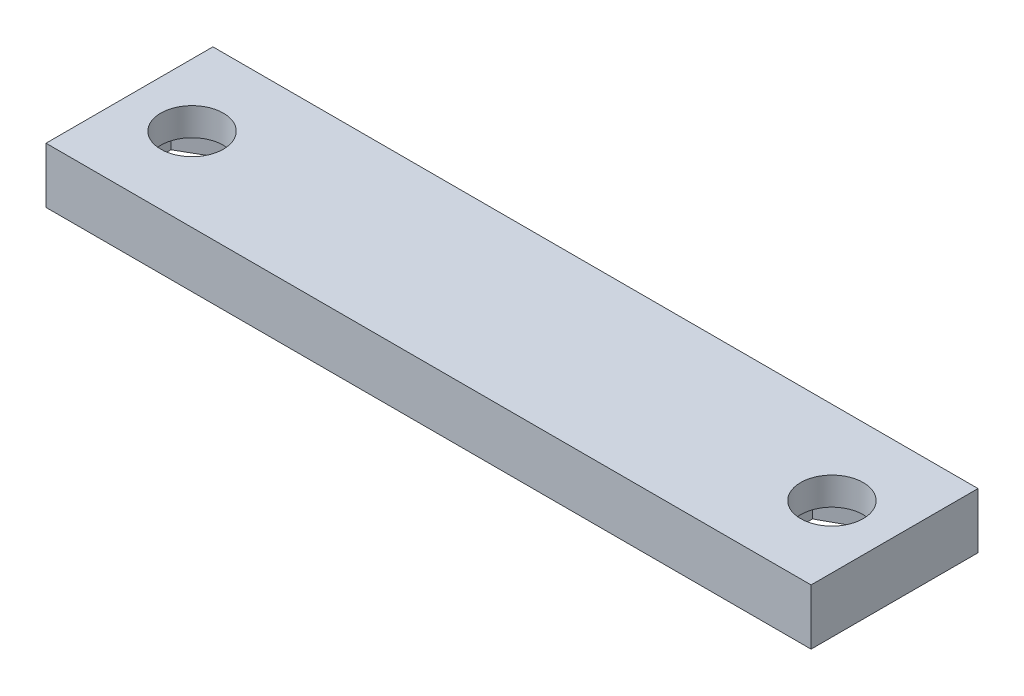
ISO-10303-21;
HEADER;
FILE_DESCRIPTION(('STEP AP214'),'2;1');
FILE_NAME('part.step','',(''),(''),'','','');
FILE_SCHEMA(('AUTOMOTIVE_DESIGN { 1 0 10303 214 1 1 1 1 }'));
ENDSEC;
DATA;
#1=APPLICATION_CONTEXT('core data for automotive mechanical design processes');
#2=APPLICATION_PROTOCOL_DEFINITION('international standard','automotive_design',2000,#1);
#3=PRODUCT_CONTEXT('',#1,'mechanical');
#4=PRODUCT('Part','Part','',(#3));
#5=PRODUCT_RELATED_PRODUCT_CATEGORY('part','',(#4));
#6=PRODUCT_DEFINITION_FORMATION('','',#4);
#7=PRODUCT_DEFINITION_CONTEXT('part definition',#1,'design');
#8=PRODUCT_DEFINITION('design','',#6,#7);
#9=PRODUCT_DEFINITION_SHAPE('','',#8);
#10=(LENGTH_UNIT() NAMED_UNIT(*) SI_UNIT(.MILLI.,.METRE.));
#11=(NAMED_UNIT(*) PLANE_ANGLE_UNIT() SI_UNIT($,.RADIAN.));
#12=(NAMED_UNIT(*) SI_UNIT($,.STERADIAN.) SOLID_ANGLE_UNIT());
#13=UNCERTAINTY_MEASURE_WITH_UNIT(LENGTH_MEASURE(1.E-05),#10,'distance_accuracy_value','');
#14=(GEOMETRIC_REPRESENTATION_CONTEXT(3) GLOBAL_UNCERTAINTY_ASSIGNED_CONTEXT((#13)) GLOBAL_UNIT_ASSIGNED_CONTEXT((#10,
#11,#12)) REPRESENTATION_CONTEXT('',''));
#15=CARTESIAN_POINT('',(0.,0.,0.));
#16=DIRECTION('',(0.,0.,1.));
#17=DIRECTION('',(1.,0.,0.));
#18=AXIS2_PLACEMENT_3D('',#15,#16,#17);
#19=CARTESIAN_POINT('',(-23.,4.,0.));
#20=DIRECTION('',(0.,-1.,0.));
#21=DIRECTION('',(0.,0.,-1.));
#22=AXIS2_PLACEMENT_3D('',#19,#20,#21);
#23=CYLINDRICAL_SURFACE('',#22,2.25);
#24=CARTESIAN_POINT('',(-23.,4.,0.));
#25=DIRECTION('',(0.,1.,0.));
#26=DIRECTION('',(0.,0.,1.));
#27=AXIS2_PLACEMENT_3D('',#24,#25,#26);
#28=CIRCLE('',#27,2.25);
#29=CARTESIAN_POINT('',(-23.,4.,2.25));
#30=VERTEX_POINT('',#29);
#31=EDGE_CURVE('E252',#30,#30,#28,.T.);
#32=ORIENTED_EDGE('',*,*,#31,.T.);
#33=EDGE_LOOP('',(#32));
#34=FACE_BOUND('',#33,.T.);
#35=CARTESIAN_POINT('',(-23.,2.,0.));
#36=DIRECTION('',(0.,-1.,0.));
#37=DIRECTION('',(0.,0.,-1.));
#38=AXIS2_PLACEMENT_3D('',#35,#36,#37);
#39=CIRCLE('',#38,2.25);
#40=CARTESIAN_POINT('',(-23.,2.,-2.25));
#41=VERTEX_POINT('',#40);
#42=EDGE_CURVE('E37',#41,#41,#39,.T.);
#43=ORIENTED_EDGE('',*,*,#42,.T.);
#44=EDGE_LOOP('',(#43));
#45=FACE_BOUND('',#44,.T.);
#46=ADVANCED_FACE('F33',(#34,#45),#23,.F.);
#47=CARTESIAN_POINT('',(23.,4.,0.));
#48=DIRECTION('',(0.,-1.,0.));
#49=DIRECTION('',(0.,0.,-1.));
#50=AXIS2_PLACEMENT_3D('',#47,#48,#49);
#51=CYLINDRICAL_SURFACE('',#50,2.25);
#52=CARTESIAN_POINT('',(23.,4.,0.));
#53=DIRECTION('',(0.,1.,0.));
#54=DIRECTION('',(0.,0.,1.));
#55=AXIS2_PLACEMENT_3D('',#52,#53,#54);
#56=CIRCLE('',#55,2.25);
#57=CARTESIAN_POINT('',(23.,4.,2.25));
#58=VERTEX_POINT('',#57);
#59=EDGE_CURVE('E249',#58,#58,#56,.T.);
#60=ORIENTED_EDGE('',*,*,#59,.T.);
#61=EDGE_LOOP('',(#60));
#62=FACE_BOUND('',#61,.T.);
#63=CARTESIAN_POINT('',(23.,2.,0.));
#64=DIRECTION('',(0.,-1.,0.));
#65=DIRECTION('',(0.,0.,-1.));
#66=AXIS2_PLACEMENT_3D('',#63,#64,#65);
#67=CIRCLE('',#66,2.25);
#68=CARTESIAN_POINT('',(23.,2.,-2.25));
#69=VERTEX_POINT('',#68);
#70=EDGE_CURVE('E239',#69,#69,#67,.T.);
#71=ORIENTED_EDGE('',*,*,#70,.T.);
#72=EDGE_LOOP('',(#71));
#73=FACE_BOUND('',#72,.T.);
#74=ADVANCED_FACE('F283',(#62,#73),#51,.F.);
#75=CARTESIAN_POINT('',(0.,4.,0.));
#76=DIRECTION('',(0.,1.,0.));
#77=DIRECTION('',(0.,0.,1.));
#78=AXIS2_PLACEMENT_3D('',#75,#76,#77);
#79=PLANE('',#78);
#80=ORIENTED_EDGE('',*,*,#31,.F.);
#81=EDGE_LOOP('',(#80));
#82=FACE_BOUND('',#81,.T.);
#83=DIRECTION('',(0.,0.,-1.));
#84=VECTOR('',#83,1.);
#85=CARTESIAN_POINT('',(27.5,4.,-6.));
#86=LINE('',#85,#84);
#87=CARTESIAN_POINT('',(27.5,4.,6.));
#88=VERTEX_POINT('',#87);
#89=CARTESIAN_POINT('',(27.5,4.,-6.));
#90=VERTEX_POINT('',#89);
#91=EDGE_CURVE('E256',#88,#90,#86,.T.);
#92=ORIENTED_EDGE('',*,*,#91,.T.);
#93=DIRECTION('',(-1.,0.,0.));
#94=VECTOR('',#93,1.);
#95=CARTESIAN_POINT('',(-27.5,4.,-6.));
#96=LINE('',#95,#94);
#97=CARTESIAN_POINT('',(-27.5,4.,-6.));
#98=VERTEX_POINT('',#97);
#99=EDGE_CURVE('E259',#90,#98,#96,.T.);
#100=ORIENTED_EDGE('',*,*,#99,.T.);
#101=DIRECTION('',(0.,0.,1.));
#102=VECTOR('',#101,1.);
#103=CARTESIAN_POINT('',(-27.5,4.,-6.));
#104=LINE('',#103,#102);
#105=CARTESIAN_POINT('',(-27.5,4.,6.));
#106=VERTEX_POINT('',#105);
#107=EDGE_CURVE('E262',#98,#106,#104,.T.);
#108=ORIENTED_EDGE('',*,*,#107,.T.);
#109=DIRECTION('',(1.,0.,0.));
#110=VECTOR('',#109,1.);
#111=CARTESIAN_POINT('',(-27.5,4.,6.));
#112=LINE('',#111,#110);
#113=EDGE_CURVE('E264',#106,#88,#112,.T.);
#114=ORIENTED_EDGE('',*,*,#113,.T.);
#115=EDGE_LOOP('',(#92,#100,#108,#114));
#116=FACE_BOUND('',#115,.T.);
#117=ORIENTED_EDGE('',*,*,#59,.F.);
#118=EDGE_LOOP('',(#117));
#119=FACE_BOUND('',#118,.T.);
#120=ADVANCED_FACE('F315',(#82,#116,#119),#79,.T.);
#121=CARTESIAN_POINT('',(0.,0.,0.));
#122=DIRECTION('',(0.,1.,0.));
#123=DIRECTION('',(0.,0.,1.));
#124=AXIS2_PLACEMENT_3D('',#121,#122,#123);
#125=PLANE('',#124);
#126=DIRECTION('',(0.866025403784439,0.,0.5));
#127=VECTOR('',#126,1.);
#128=CARTESIAN_POINT('',(-23.,0.,-4.15692193816531));
#129=LINE('',#128,#127);
#130=CARTESIAN_POINT('',(-23.,0.,-4.15692193816531));
#131=VERTEX_POINT('',#130);
#132=CARTESIAN_POINT('',(-19.4,0.,-2.07846096908265));
#133=VERTEX_POINT('',#132);
#134=EDGE_CURVE('E183',#131,#133,#129,.T.);
#135=ORIENTED_EDGE('',*,*,#134,.F.);
#136=DIRECTION('',(0.866025403784439,0.,-0.5));
#137=VECTOR('',#136,1.);
#138=CARTESIAN_POINT('',(-26.6,0.,-2.07846096908265));
#139=LINE('',#138,#137);
#140=CARTESIAN_POINT('',(-26.6,0.,-2.07846096908265));
#141=VERTEX_POINT('',#140);
#142=EDGE_CURVE('E50',#141,#131,#139,.T.);
#143=ORIENTED_EDGE('',*,*,#142,.F.);
#144=DIRECTION('',(0.,0.,-1.));
#145=VECTOR('',#144,1.);
#146=CARTESIAN_POINT('',(-26.6,0.,2.07846096908265));
#147=LINE('',#146,#145);
#148=CARTESIAN_POINT('',(-26.6,0.,2.07846096908265));
#149=VERTEX_POINT('',#148);
#150=EDGE_CURVE('E169',#149,#141,#147,.T.);
#151=ORIENTED_EDGE('',*,*,#150,.F.);
#152=DIRECTION('',(-0.866025403784439,0.,-0.5));
#153=VECTOR('',#152,1.);
#154=CARTESIAN_POINT('',(-23.,0.,4.15692193816531));
#155=LINE('',#154,#153);
#156=CARTESIAN_POINT('',(-23.,0.,4.15692193816531));
#157=VERTEX_POINT('',#156);
#158=EDGE_CURVE('E172',#157,#149,#155,.T.);
#159=ORIENTED_EDGE('',*,*,#158,.F.);
#160=DIRECTION('',(-0.866025403784439,0.,0.5));
#161=VECTOR('',#160,1.);
#162=CARTESIAN_POINT('',(-19.4,0.,2.07846096908265));
#163=LINE('',#162,#161);
#164=CARTESIAN_POINT('',(-19.4,0.,2.07846096908265));
#165=VERTEX_POINT('',#164);
#166=EDGE_CURVE('E188',#165,#157,#163,.T.);
#167=ORIENTED_EDGE('',*,*,#166,.F.);
#168=DIRECTION('',(0.,0.,1.));
#169=VECTOR('',#168,1.);
#170=CARTESIAN_POINT('',(-19.4,0.,-2.07846096908265));
#171=LINE('',#170,#169);
#172=EDGE_CURVE('E185',#133,#165,#171,.T.);
#173=ORIENTED_EDGE('',*,*,#172,.F.);
#174=EDGE_LOOP('',(#135,#143,#151,#159,#167,#173));
#175=FACE_BOUND('',#174,.T.);
#176=DIRECTION('',(0.877399501832216,0.,-0.479760475846623));
#177=VECTOR('',#176,1.);
#178=CARTESIAN_POINT('',(19.4492216681013,0.,-2.16147478304026));
#179=LINE('',#178,#177);
#180=CARTESIAN_POINT('',(19.4492216681013,0.,-2.16147478304026));
#181=VERTEX_POINT('',#180);
#182=CARTESIAN_POINT('',(23.096502905803,0.,-4.15580163015171));
#183=VERTEX_POINT('',#182);
#184=EDGE_CURVE('E223',#181,#183,#179,.T.);
#185=ORIENTED_EDGE('',*,*,#184,.F.);
#186=DIRECTION('',(0.0232149911012231,0.,-0.999730495777822));
#187=VECTOR('',#186,1.);
#188=CARTESIAN_POINT('',(19.3527187622984,0.,1.99432684711145));
#189=LINE('',#188,#187);
#190=CARTESIAN_POINT('',(19.3527187622984,0.,1.99432684711145));
#191=VERTEX_POINT('',#190);
#192=EDGE_CURVE('E58',#191,#181,#189,.T.);
#193=ORIENTED_EDGE('',*,*,#192,.F.);
#194=DIRECTION('',(-0.854184510730994,0.,-0.5199700199312));
#195=VECTOR('',#194,1.);
#196=CARTESIAN_POINT('',(22.903497094197,0.,4.1558016301517));
#197=LINE('',#196,#195);
#198=CARTESIAN_POINT('',(22.903497094197,0.,4.1558016301517));
#199=VERTEX_POINT('',#198);
#200=EDGE_CURVE('E206',#199,#191,#197,.T.);
#201=ORIENTED_EDGE('',*,*,#200,.F.);
#202=DIRECTION('',(-0.877399501832217,0.,0.479760475846623));
#203=VECTOR('',#202,1.);
#204=CARTESIAN_POINT('',(26.5507783318987,0.,2.16147478304025));
#205=LINE('',#204,#203);
#206=CARTESIAN_POINT('',(26.5507783318987,0.,2.16147478304025));
#207=VERTEX_POINT('',#206);
#208=EDGE_CURVE('E232',#207,#199,#205,.T.);
#209=ORIENTED_EDGE('',*,*,#208,.F.);
#210=DIRECTION('',(-0.0232149911012231,0.,0.999730495777822));
#211=VECTOR('',#210,1.);
#212=CARTESIAN_POINT('',(26.6472812377017,0.,-1.99432684711145));
#213=LINE('',#212,#211);
#214=CARTESIAN_POINT('',(26.6472812377017,0.,-1.99432684711145));
#215=VERTEX_POINT('',#214);
#216=EDGE_CURVE('E229',#215,#207,#213,.T.);
#217=ORIENTED_EDGE('',*,*,#216,.F.);
#218=DIRECTION('',(0.854184510730994,0.,0.5199700199312));
#219=VECTOR('',#218,1.);
#220=CARTESIAN_POINT('',(23.096502905803,0.,-4.15580163015171));
#221=LINE('',#220,#219);
#222=EDGE_CURVE('E226',#183,#215,#221,.T.);
#223=ORIENTED_EDGE('',*,*,#222,.F.);
#224=EDGE_LOOP('',(#185,#193,#201,#209,#217,#223));
#225=FACE_BOUND('',#224,.T.);
#226=DIRECTION('',(0.,0.,-1.));
#227=VECTOR('',#226,1.);
#228=CARTESIAN_POINT('',(27.5,0.,-6.));
#229=LINE('',#228,#227);
#230=CARTESIAN_POINT('',(27.5,0.,6.));
#231=VERTEX_POINT('',#230);
#232=CARTESIAN_POINT('',(27.5,0.,-6.));
#233=VERTEX_POINT('',#232);
#234=EDGE_CURVE('E255',#231,#233,#229,.T.);
#235=ORIENTED_EDGE('',*,*,#234,.F.);
#236=DIRECTION('',(1.,0.,0.));
#237=VECTOR('',#236,1.);
#238=CARTESIAN_POINT('',(-27.5,0.,6.));
#239=LINE('',#238,#237);
#240=CARTESIAN_POINT('',(-27.5,0.,6.));
#241=VERTEX_POINT('',#240);
#242=EDGE_CURVE('E260',#241,#231,#239,.T.);
#243=ORIENTED_EDGE('',*,*,#242,.F.);
#244=DIRECTION('',(0.,0.,1.));
#245=VECTOR('',#244,1.);
#246=CARTESIAN_POINT('',(-27.5,0.,-6.));
#247=LINE('',#246,#245);
#248=CARTESIAN_POINT('',(-27.5,0.,-6.));
#249=VERTEX_POINT('',#248);
#250=EDGE_CURVE('E271',#249,#241,#247,.T.);
#251=ORIENTED_EDGE('',*,*,#250,.F.);
#252=DIRECTION('',(-1.,0.,0.));
#253=VECTOR('',#252,1.);
#254=CARTESIAN_POINT('',(-27.5,0.,-6.));
#255=LINE('',#254,#253);
#256=EDGE_CURVE('E269',#233,#249,#255,.T.);
#257=ORIENTED_EDGE('',*,*,#256,.F.);
#258=EDGE_LOOP('',(#235,#243,#251,#257));
#259=FACE_BOUND('',#258,.T.);
#260=ADVANCED_FACE('F312',(#175,#225,#259),#125,.F.);
#261=CARTESIAN_POINT('',(27.5,4.,-6.));
#262=DIRECTION('',(-1.,0.,0.));
#263=DIRECTION('',(0.,0.,1.));
#264=AXIS2_PLACEMENT_3D('',#261,#262,#263);
#265=PLANE('',#264);
#266=ORIENTED_EDGE('',*,*,#234,.T.);
#267=DIRECTION('',(0.,-1.,0.));
#268=VECTOR('',#267,1.);
#269=CARTESIAN_POINT('',(27.5,4.,-6.));
#270=LINE('',#269,#268);
#271=EDGE_CURVE('E11',#90,#233,#270,.T.);
#272=ORIENTED_EDGE('',*,*,#271,.F.);
#273=ORIENTED_EDGE('',*,*,#91,.F.);
#274=DIRECTION('',(0.,-1.,0.));
#275=VECTOR('',#274,1.);
#276=CARTESIAN_POINT('',(27.5,4.,6.));
#277=LINE('',#276,#275);
#278=EDGE_CURVE('E266',#88,#231,#277,.T.);
#279=ORIENTED_EDGE('',*,*,#278,.T.);
#280=EDGE_LOOP('',(#266,#272,#273,#279));
#281=FACE_BOUND('',#280,.T.);
#282=ADVANCED_FACE('F35',(#281),#265,.F.);
#283=CARTESIAN_POINT('',(-27.5,4.,-6.));
#284=DIRECTION('',(0.,0.,1.));
#285=DIRECTION('',(1.,0.,0.));
#286=AXIS2_PLACEMENT_3D('',#283,#284,#285);
#287=PLANE('',#286);
#288=ORIENTED_EDGE('',*,*,#256,.T.);
#289=DIRECTION('',(0.,-1.,0.));
#290=VECTOR('',#289,1.);
#291=CARTESIAN_POINT('',(-27.5,4.,-6.));
#292=LINE('',#291,#290);
#293=EDGE_CURVE('E42',#98,#249,#292,.T.);
#294=ORIENTED_EDGE('',*,*,#293,.F.);
#295=ORIENTED_EDGE('',*,*,#99,.F.);
#296=ORIENTED_EDGE('',*,*,#271,.T.);
#297=EDGE_LOOP('',(#288,#294,#295,#296));
#298=FACE_BOUND('',#297,.T.);
#299=ADVANCED_FACE('F334',(#298),#287,.F.);
#300=CARTESIAN_POINT('',(-27.5,4.,-6.));
#301=DIRECTION('',(1.,0.,0.));
#302=DIRECTION('',(0.,0.,-1.));
#303=AXIS2_PLACEMENT_3D('',#300,#301,#302);
#304=PLANE('',#303);
#305=ORIENTED_EDGE('',*,*,#250,.T.);
#306=DIRECTION('',(0.,-1.,0.));
#307=VECTOR('',#306,1.);
#308=CARTESIAN_POINT('',(-27.5,4.,6.));
#309=LINE('',#308,#307);
#310=EDGE_CURVE('E276',#106,#241,#309,.T.);
#311=ORIENTED_EDGE('',*,*,#310,.F.);
#312=ORIENTED_EDGE('',*,*,#107,.F.);
#313=ORIENTED_EDGE('',*,*,#293,.T.);
#314=EDGE_LOOP('',(#305,#311,#312,#313));
#315=FACE_BOUND('',#314,.T.);
#316=ADVANCED_FACE('F331',(#315),#304,.F.);
#317=CARTESIAN_POINT('',(-27.5,4.,6.));
#318=DIRECTION('',(0.,0.,-1.));
#319=DIRECTION('',(-1.,0.,0.));
#320=AXIS2_PLACEMENT_3D('',#317,#318,#319);
#321=PLANE('',#320);
#322=ORIENTED_EDGE('',*,*,#242,.T.);
#323=ORIENTED_EDGE('',*,*,#278,.F.);
#324=ORIENTED_EDGE('',*,*,#113,.F.);
#325=ORIENTED_EDGE('',*,*,#310,.T.);
#326=EDGE_LOOP('',(#322,#323,#324,#325));
#327=FACE_BOUND('',#326,.T.);
#328=ADVANCED_FACE('F327',(#327),#321,.F.);
#329=CARTESIAN_POINT('',(19.3527187622984,2.,1.99432684711145));
#330=DIRECTION('',(-0.999730495777822,0.,-0.0232149911012231));
#331=DIRECTION('',(-0.0232149911012231,0.,0.999730495777822));
#332=AXIS2_PLACEMENT_3D('',#329,#330,#331);
#333=PLANE('',#332);
#334=ORIENTED_EDGE('',*,*,#192,.T.);
#335=DIRECTION('',(0.,-1.,0.));
#336=VECTOR('',#335,1.);
#337=CARTESIAN_POINT('',(19.4492216681013,2.,-2.16147478304026));
#338=LINE('',#337,#336);
#339=CARTESIAN_POINT('',(19.4492216681013,2.,-2.16147478304026));
#340=VERTEX_POINT('',#339);
#341=EDGE_CURVE('E221',#340,#181,#338,.T.);
#342=ORIENTED_EDGE('',*,*,#341,.F.);
#343=DIRECTION('',(0.0232149911012231,0.,-0.999730495777822));
#344=VECTOR('',#343,1.);
#345=CARTESIAN_POINT('',(19.3527187622984,2.,1.99432684711145));
#346=LINE('',#345,#344);
#347=CARTESIAN_POINT('',(19.3527187622984,2.,1.99432684711145));
#348=VERTEX_POINT('',#347);
#349=EDGE_CURVE('E202',#348,#340,#346,.T.);
#350=ORIENTED_EDGE('',*,*,#349,.F.);
#351=DIRECTION('',(0.,-1.,0.));
#352=VECTOR('',#351,1.);
#353=CARTESIAN_POINT('',(19.3527187622984,2.,1.99432684711145));
#354=LINE('',#353,#352);
#355=EDGE_CURVE('E237',#348,#191,#354,.T.);
#356=ORIENTED_EDGE('',*,*,#355,.T.);
#357=EDGE_LOOP('',(#334,#342,#350,#356));
#358=FACE_BOUND('',#357,.T.);
#359=ADVANCED_FACE('F293',(#358),#333,.F.);
#360=CARTESIAN_POINT('',(22.903497094197,2.,4.1558016301517));
#361=DIRECTION('',(-0.5199700199312,0.,0.854184510730994));
#362=DIRECTION('',(0.854184510730994,0.,0.5199700199312));
#363=AXIS2_PLACEMENT_3D('',#360,#361,#362);
#364=PLANE('',#363);
#365=ORIENTED_EDGE('',*,*,#200,.T.);
#366=ORIENTED_EDGE('',*,*,#355,.F.);
#367=DIRECTION('',(-0.854184510730994,0.,-0.5199700199312));
#368=VECTOR('',#367,1.);
#369=CARTESIAN_POINT('',(22.903497094197,2.,4.1558016301517));
#370=LINE('',#369,#368);
#371=CARTESIAN_POINT('',(22.903497094197,2.,4.1558016301517));
#372=VERTEX_POINT('',#371);
#373=EDGE_CURVE('E218',#372,#348,#370,.T.);
#374=ORIENTED_EDGE('',*,*,#373,.F.);
#375=DIRECTION('',(0.,-1.,0.));
#376=VECTOR('',#375,1.);
#377=CARTESIAN_POINT('',(22.903497094197,2.,4.1558016301517));
#378=LINE('',#377,#376);
#379=EDGE_CURVE('E240',#372,#199,#378,.T.);
#380=ORIENTED_EDGE('',*,*,#379,.T.);
#381=EDGE_LOOP('',(#365,#366,#374,#380));
#382=FACE_BOUND('',#381,.T.);
#383=ADVANCED_FACE('F310',(#382),#364,.F.);
#384=CARTESIAN_POINT('',(26.5507783318987,2.,2.16147478304025));
#385=DIRECTION('',(0.479760475846623,0.,0.877399501832217));
#386=DIRECTION('',(0.877399501832217,0.,-0.479760475846623));
#387=AXIS2_PLACEMENT_3D('',#384,#385,#386);
#388=PLANE('',#387);
#389=ORIENTED_EDGE('',*,*,#208,.T.);
#390=ORIENTED_EDGE('',*,*,#379,.F.);
#391=DIRECTION('',(-0.877399501832217,0.,0.479760475846623));
#392=VECTOR('',#391,1.);
#393=CARTESIAN_POINT('',(26.5507783318987,2.,2.16147478304025));
#394=LINE('',#393,#392);
#395=CARTESIAN_POINT('',(26.5507783318987,2.,2.16147478304025));
#396=VERTEX_POINT('',#395);
#397=EDGE_CURVE('E215',#396,#372,#394,.T.);
#398=ORIENTED_EDGE('',*,*,#397,.F.);
#399=DIRECTION('',(0.,-1.,0.));
#400=VECTOR('',#399,1.);
#401=CARTESIAN_POINT('',(26.5507783318987,2.,2.16147478304025));
#402=LINE('',#401,#400);
#403=EDGE_CURVE('E242',#396,#207,#402,.T.);
#404=ORIENTED_EDGE('',*,*,#403,.T.);
#405=EDGE_LOOP('',(#389,#390,#398,#404));
#406=FACE_BOUND('',#405,.T.);
#407=ADVANCED_FACE('F307',(#406),#388,.F.);
#408=CARTESIAN_POINT('',(26.6472812377017,2.,-1.99432684711145));
#409=DIRECTION('',(0.999730495777822,0.,0.0232149911012231));
#410=DIRECTION('',(0.0232149911012231,0.,-0.999730495777822));
#411=AXIS2_PLACEMENT_3D('',#408,#409,#410);
#412=PLANE('',#411);
#413=ORIENTED_EDGE('',*,*,#216,.T.);
#414=ORIENTED_EDGE('',*,*,#403,.F.);
#415=DIRECTION('',(-0.0232149911012231,0.,0.999730495777822));
#416=VECTOR('',#415,1.);
#417=CARTESIAN_POINT('',(26.6472812377017,2.,-1.99432684711145));
#418=LINE('',#417,#416);
#419=CARTESIAN_POINT('',(26.6472812377017,2.,-1.99432684711145));
#420=VERTEX_POINT('',#419);
#421=EDGE_CURVE('E212',#420,#396,#418,.T.);
#422=ORIENTED_EDGE('',*,*,#421,.F.);
#423=DIRECTION('',(0.,-1.,0.));
#424=VECTOR('',#423,1.);
#425=CARTESIAN_POINT('',(26.6472812377017,2.,-1.99432684711145));
#426=LINE('',#425,#424);
#427=EDGE_CURVE('E244',#420,#215,#426,.T.);
#428=ORIENTED_EDGE('',*,*,#427,.T.);
#429=EDGE_LOOP('',(#413,#414,#422,#428));
#430=FACE_BOUND('',#429,.T.);
#431=ADVANCED_FACE('F303',(#430),#412,.F.);
#432=CARTESIAN_POINT('',(23.096502905803,2.,-4.15580163015171));
#433=DIRECTION('',(0.5199700199312,0.,-0.854184510730994));
#434=DIRECTION('',(-0.854184510730994,0.,-0.5199700199312));
#435=AXIS2_PLACEMENT_3D('',#432,#433,#434);
#436=PLANE('',#435);
#437=ORIENTED_EDGE('',*,*,#222,.T.);
#438=ORIENTED_EDGE('',*,*,#427,.F.);
#439=DIRECTION('',(0.854184510730994,0.,0.5199700199312));
#440=VECTOR('',#439,1.);
#441=CARTESIAN_POINT('',(23.096502905803,2.,-4.15580163015171));
#442=LINE('',#441,#440);
#443=CARTESIAN_POINT('',(23.096502905803,2.,-4.15580163015171));
#444=VERTEX_POINT('',#443);
#445=EDGE_CURVE('E209',#444,#420,#442,.T.);
#446=ORIENTED_EDGE('',*,*,#445,.F.);
#447=DIRECTION('',(0.,-1.,0.));
#448=VECTOR('',#447,1.);
#449=CARTESIAN_POINT('',(23.096502905803,2.,-4.15580163015171));
#450=LINE('',#449,#448);
#451=EDGE_CURVE('E246',#444,#183,#450,.T.);
#452=ORIENTED_EDGE('',*,*,#451,.T.);
#453=EDGE_LOOP('',(#437,#438,#446,#452));
#454=FACE_BOUND('',#453,.T.);
#455=ADVANCED_FACE('F299',(#454),#436,.F.);
#456=CARTESIAN_POINT('',(19.4492216681013,2.,-2.16147478304026));
#457=DIRECTION('',(-0.479760475846623,0.,-0.877399501832217));
#458=DIRECTION('',(-0.877399501832217,0.,0.479760475846623));
#459=AXIS2_PLACEMENT_3D('',#456,#457,#458);
#460=PLANE('',#459);
#461=ORIENTED_EDGE('',*,*,#184,.T.);
#462=ORIENTED_EDGE('',*,*,#451,.F.);
#463=DIRECTION('',(0.877399501832216,0.,-0.479760475846623));
#464=VECTOR('',#463,1.);
#465=CARTESIAN_POINT('',(19.4492216681013,2.,-2.16147478304026));
#466=LINE('',#465,#464);
#467=EDGE_CURVE('E205',#340,#444,#466,.T.);
#468=ORIENTED_EDGE('',*,*,#467,.F.);
#469=ORIENTED_EDGE('',*,*,#341,.T.);
#470=EDGE_LOOP('',(#461,#462,#468,#469));
#471=FACE_BOUND('',#470,.T.);
#472=ADVANCED_FACE('F288',(#471),#460,.F.);
#473=CARTESIAN_POINT('',(0.,2.,0.));
#474=DIRECTION('',(0.,-1.,0.));
#475=DIRECTION('',(0.,0.,-1.));
#476=AXIS2_PLACEMENT_3D('',#473,#474,#475);
#477=PLANE('',#476);
#478=ORIENTED_EDGE('',*,*,#70,.F.);
#479=EDGE_LOOP('',(#478));
#480=FACE_BOUND('',#479,.T.);
#481=ORIENTED_EDGE('',*,*,#349,.T.);
#482=ORIENTED_EDGE('',*,*,#467,.T.);
#483=ORIENTED_EDGE('',*,*,#445,.T.);
#484=ORIENTED_EDGE('',*,*,#421,.T.);
#485=ORIENTED_EDGE('',*,*,#397,.T.);
#486=ORIENTED_EDGE('',*,*,#373,.T.);
#487=EDGE_LOOP('',(#481,#482,#483,#484,#485,#486));
#488=FACE_BOUND('',#487,.T.);
#489=ADVANCED_FACE('F285',(#480,#488),#477,.T.);
#490=CARTESIAN_POINT('',(-26.6,2.,-2.07846096908265));
#491=DIRECTION('',(-0.5,0.,-0.866025403784439));
#492=DIRECTION('',(-0.866025403784439,0.,0.5));
#493=AXIS2_PLACEMENT_3D('',#490,#491,#492);
#494=PLANE('',#493);
#495=ORIENTED_EDGE('',*,*,#142,.T.);
#496=DIRECTION('',(0.,-1.,0.));
#497=VECTOR('',#496,1.);
#498=CARTESIAN_POINT('',(-23.,2.,-4.15692193816531));
#499=LINE('',#498,#497);
#500=CARTESIAN_POINT('',(-23.,2.,-4.15692193816531));
#501=VERTEX_POINT('',#500);
#502=EDGE_CURVE('E146',#501,#131,#499,.T.);
#503=ORIENTED_EDGE('',*,*,#502,.F.);
#504=DIRECTION('',(0.866025403784439,0.,-0.5));
#505=VECTOR('',#504,1.);
#506=CARTESIAN_POINT('',(-26.6,2.,-2.07846096908265));
#507=LINE('',#506,#505);
#508=CARTESIAN_POINT('',(-26.6,2.,-2.07846096908265));
#509=VERTEX_POINT('',#508);
#510=EDGE_CURVE('E150',#509,#501,#507,.T.);
#511=ORIENTED_EDGE('',*,*,#510,.F.);
#512=DIRECTION('',(0.,-1.,0.));
#513=VECTOR('',#512,1.);
#514=CARTESIAN_POINT('',(-26.6,2.,-2.07846096908265));
#515=LINE('',#514,#513);
#516=EDGE_CURVE('E193',#509,#141,#515,.T.);
#517=ORIENTED_EDGE('',*,*,#516,.T.);
#518=EDGE_LOOP('',(#495,#503,#511,#517));
#519=FACE_BOUND('',#518,.T.);
#520=ADVANCED_FACE('F148',(#519),#494,.F.);
#521=CARTESIAN_POINT('',(-26.6,2.,2.07846096908265));
#522=DIRECTION('',(-1.,0.,0.));
#523=DIRECTION('',(0.,0.,1.));
#524=AXIS2_PLACEMENT_3D('',#521,#522,#523);
#525=PLANE('',#524);
#526=ORIENTED_EDGE('',*,*,#150,.T.);
#527=ORIENTED_EDGE('',*,*,#516,.F.);
#528=DIRECTION('',(0.,0.,-1.));
#529=VECTOR('',#528,1.);
#530=CARTESIAN_POINT('',(-26.6,2.,2.07846096908265));
#531=LINE('',#530,#529);
#532=CARTESIAN_POINT('',(-26.6,2.,2.07846096908265));
#533=VERTEX_POINT('',#532);
#534=EDGE_CURVE('E156',#533,#509,#531,.T.);
#535=ORIENTED_EDGE('',*,*,#534,.F.);
#536=DIRECTION('',(0.,-1.,0.));
#537=VECTOR('',#536,1.);
#538=CARTESIAN_POINT('',(-26.6,2.,2.07846096908265));
#539=LINE('',#538,#537);
#540=EDGE_CURVE('E195',#533,#149,#539,.T.);
#541=ORIENTED_EDGE('',*,*,#540,.T.);
#542=EDGE_LOOP('',(#526,#527,#535,#541));
#543=FACE_BOUND('',#542,.T.);
#544=ADVANCED_FACE('F451',(#543),#525,.F.);
#545=CARTESIAN_POINT('',(-23.,2.,4.15692193816531));
#546=DIRECTION('',(-0.5,0.,0.866025403784439));
#547=DIRECTION('',(0.866025403784439,0.,0.5));
#548=AXIS2_PLACEMENT_3D('',#545,#546,#547);
#549=PLANE('',#548);
#550=ORIENTED_EDGE('',*,*,#158,.T.);
#551=ORIENTED_EDGE('',*,*,#540,.F.);
#552=DIRECTION('',(-0.866025403784439,0.,-0.5));
#553=VECTOR('',#552,1.);
#554=CARTESIAN_POINT('',(-23.,2.,4.15692193816531));
#555=LINE('',#554,#553);
#556=CARTESIAN_POINT('',(-23.,2.,4.15692193816531));
#557=VERTEX_POINT('',#556);
#558=EDGE_CURVE('E179',#557,#533,#555,.T.);
#559=ORIENTED_EDGE('',*,*,#558,.F.);
#560=DIRECTION('',(0.,-1.,0.));
#561=VECTOR('',#560,1.);
#562=CARTESIAN_POINT('',(-23.,2.,4.15692193816531));
#563=LINE('',#562,#561);
#564=EDGE_CURVE('E197',#557,#157,#563,.T.);
#565=ORIENTED_EDGE('',*,*,#564,.T.);
#566=EDGE_LOOP('',(#550,#551,#559,#565));
#567=FACE_BOUND('',#566,.T.);
#568=ADVANCED_FACE('F459',(#567),#549,.F.);
#569=CARTESIAN_POINT('',(-19.4,2.,2.07846096908265));
#570=DIRECTION('',(0.5,0.,0.866025403784438));
#571=DIRECTION('',(0.866025403784439,0.,-0.5));
#572=AXIS2_PLACEMENT_3D('',#569,#570,#571);
#573=PLANE('',#572);
#574=ORIENTED_EDGE('',*,*,#166,.T.);
#575=ORIENTED_EDGE('',*,*,#564,.F.);
#576=DIRECTION('',(-0.866025403784439,0.,0.5));
#577=VECTOR('',#576,1.);
#578=CARTESIAN_POINT('',(-19.4,2.,2.07846096908265));
#579=LINE('',#578,#577);
#580=CARTESIAN_POINT('',(-19.4,2.,2.07846096908265));
#581=VERTEX_POINT('',#580);
#582=EDGE_CURVE('E176',#581,#557,#579,.T.);
#583=ORIENTED_EDGE('',*,*,#582,.F.);
#584=DIRECTION('',(0.,-1.,0.));
#585=VECTOR('',#584,1.);
#586=CARTESIAN_POINT('',(-19.4,2.,2.07846096908265));
#587=LINE('',#586,#585);
#588=EDGE_CURVE('E199',#581,#165,#587,.T.);
#589=ORIENTED_EDGE('',*,*,#588,.T.);
#590=EDGE_LOOP('',(#574,#575,#583,#589));
#591=FACE_BOUND('',#590,.T.);
#592=ADVANCED_FACE('F468',(#591),#573,.F.);
#593=CARTESIAN_POINT('',(-19.4,2.,-2.07846096908265));
#594=DIRECTION('',(1.,0.,0.));
#595=DIRECTION('',(0.,0.,-1.));
#596=AXIS2_PLACEMENT_3D('',#593,#594,#595);
#597=PLANE('',#596);
#598=ORIENTED_EDGE('',*,*,#172,.T.);
#599=ORIENTED_EDGE('',*,*,#588,.F.);
#600=DIRECTION('',(0.,0.,1.));
#601=VECTOR('',#600,1.);
#602=CARTESIAN_POINT('',(-19.4,2.,-2.07846096908265));
#603=LINE('',#602,#601);
#604=CARTESIAN_POINT('',(-19.4,2.,-2.07846096908265));
#605=VERTEX_POINT('',#604);
#606=EDGE_CURVE('E164',#605,#581,#603,.T.);
#607=ORIENTED_EDGE('',*,*,#606,.F.);
#608=DIRECTION('',(0.,-1.,0.));
#609=VECTOR('',#608,1.);
#610=CARTESIAN_POINT('',(-19.4,2.,-2.07846096908265));
#611=LINE('',#610,#609);
#612=EDGE_CURVE('E155',#605,#133,#611,.T.);
#613=ORIENTED_EDGE('',*,*,#612,.T.);
#614=EDGE_LOOP('',(#598,#599,#607,#613));
#615=FACE_BOUND('',#614,.T.);
#616=ADVANCED_FACE('F477',(#615),#597,.F.);
#617=CARTESIAN_POINT('',(-23.,2.,-4.15692193816531));
#618=DIRECTION('',(0.5,0.,-0.866025403784439));
#619=DIRECTION('',(-0.866025403784439,0.,-0.5));
#620=AXIS2_PLACEMENT_3D('',#617,#618,#619);
#621=PLANE('',#620);
#622=ORIENTED_EDGE('',*,*,#134,.T.);
#623=ORIENTED_EDGE('',*,*,#612,.F.);
#624=DIRECTION('',(0.866025403784439,0.,0.5));
#625=VECTOR('',#624,1.);
#626=CARTESIAN_POINT('',(-23.,2.,-4.15692193816531));
#627=LINE('',#626,#625);
#628=EDGE_CURVE('E159',#501,#605,#627,.T.);
#629=ORIENTED_EDGE('',*,*,#628,.F.);
#630=ORIENTED_EDGE('',*,*,#502,.T.);
#631=EDGE_LOOP('',(#622,#623,#629,#630));
#632=FACE_BOUND('',#631,.T.);
#633=ADVANCED_FACE('F160',(#632),#621,.F.);
#634=CARTESIAN_POINT('',(0.,2.,0.));
#635=DIRECTION('',(0.,-1.,0.));
#636=DIRECTION('',(0.,0.,-1.));
#637=AXIS2_PLACEMENT_3D('',#634,#635,#636);
#638=PLANE('',#637);
#639=ORIENTED_EDGE('',*,*,#42,.F.);
#640=EDGE_LOOP('',(#639));
#641=FACE_BOUND('',#640,.T.);
#642=ORIENTED_EDGE('',*,*,#510,.T.);
#643=ORIENTED_EDGE('',*,*,#628,.T.);
#644=ORIENTED_EDGE('',*,*,#606,.T.);
#645=ORIENTED_EDGE('',*,*,#582,.T.);
#646=ORIENTED_EDGE('',*,*,#558,.T.);
#647=ORIENTED_EDGE('',*,*,#534,.T.);
#648=EDGE_LOOP('',(#642,#643,#644,#645,#646,#647));
#649=FACE_BOUND('',#648,.T.);
#650=ADVANCED_FACE('F166',(#641,#649),#638,.T.);
#651=CLOSED_SHELL('',(#46,#74,#120,#260,#282,#299,#316,#328,#359,#383,#407,#431,#455,#472,#489,
#520,#544,#568,#592,#616,#633,#650));
#652=MANIFOLD_SOLID_BREP('B2',#651);
#653=ADVANCED_BREP_SHAPE_REPRESENTATION('',(#18,#652),#14);
#654=SHAPE_DEFINITION_REPRESENTATION(#9,#653);
ENDSEC;
END-ISO-10303-21;
